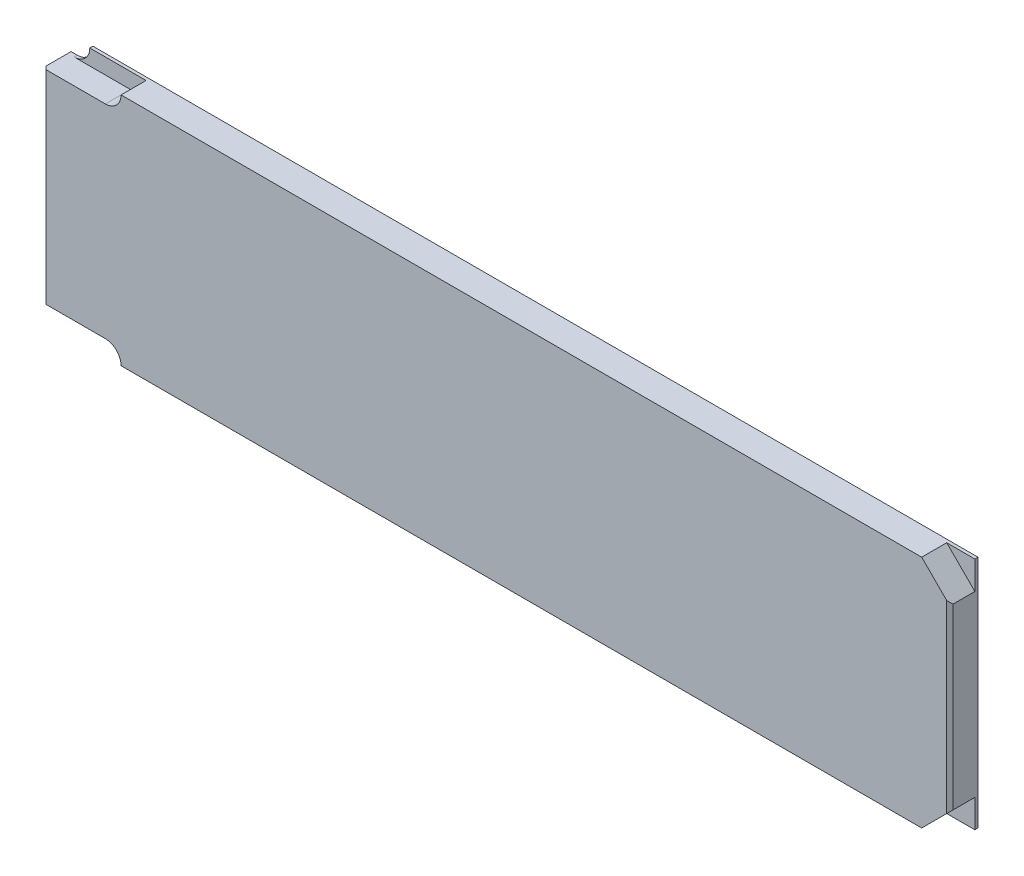
ISO-10303-21;
HEADER;
FILE_DESCRIPTION(('STEP AP214'),'2;1');
FILE_NAME('part.step','',(''),(''),'','','');
FILE_SCHEMA(('AUTOMOTIVE_DESIGN { 1 0 10303 214 1 1 1 1 }'));
ENDSEC;
DATA;
#1=APPLICATION_CONTEXT('core data for automotive mechanical design processes');
#2=APPLICATION_PROTOCOL_DEFINITION('international standard','automotive_design',2000,#1);
#3=PRODUCT_CONTEXT('',#1,'mechanical');
#4=PRODUCT('Part','Part','',(#3));
#5=PRODUCT_RELATED_PRODUCT_CATEGORY('part','',(#4));
#6=PRODUCT_DEFINITION_FORMATION('','',#4);
#7=PRODUCT_DEFINITION_CONTEXT('part definition',#1,'design');
#8=PRODUCT_DEFINITION('design','',#6,#7);
#9=PRODUCT_DEFINITION_SHAPE('','',#8);
#10=(LENGTH_UNIT() NAMED_UNIT(*) SI_UNIT(.MILLI.,.METRE.));
#11=(NAMED_UNIT(*) PLANE_ANGLE_UNIT() SI_UNIT($,.RADIAN.));
#12=(NAMED_UNIT(*) SI_UNIT($,.STERADIAN.) SOLID_ANGLE_UNIT());
#13=UNCERTAINTY_MEASURE_WITH_UNIT(LENGTH_MEASURE(1.E-05),#10,'distance_accuracy_value','');
#14=(GEOMETRIC_REPRESENTATION_CONTEXT(3) GLOBAL_UNCERTAINTY_ASSIGNED_CONTEXT((#13)) GLOBAL_UNIT_ASSIGNED_CONTEXT((#10,
#11,#12)) REPRESENTATION_CONTEXT('',''));
#15=CARTESIAN_POINT('',(0.,0.,0.));
#16=DIRECTION('',(0.,0.,1.));
#17=DIRECTION('',(1.,0.,0.));
#18=AXIS2_PLACEMENT_3D('',#15,#16,#17);
#19=CARTESIAN_POINT('',(290.,0.,9.));
#20=DIRECTION('',(-1.,0.,0.));
#21=DIRECTION('',(0.,0.,1.));
#22=AXIS2_PLACEMENT_3D('',#19,#20,#21);
#23=PLANE('',#22);
#24=DIRECTION('',(0.,0.,1.));
#25=VECTOR('',#24,1.);
#26=CARTESIAN_POINT('',(290.,66.0000000000001,0.999999999999999));
#27=LINE('',#26,#25);
#28=CARTESIAN_POINT('',(290.,66.0000000000001,0.999999999999999));
#29=VERTEX_POINT('',#28);
#30=CARTESIAN_POINT('',(290.,66.0000000000001,8.));
#31=VERTEX_POINT('',#30);
#32=EDGE_CURVE('E223',#29,#31,#27,.T.);
#33=ORIENTED_EDGE('',*,*,#32,.T.);
#34=DIRECTION('',(0.,-1.,0.));
#35=VECTOR('',#34,1.);
#36=CARTESIAN_POINT('',(290.,0.,8.));
#37=LINE('',#36,#35);
#38=CARTESIAN_POINT('',(290.,8.99999999999999,8.00000000000001));
#39=VERTEX_POINT('',#38);
#40=EDGE_CURVE('E281',#31,#39,#37,.T.);
#41=ORIENTED_EDGE('',*,*,#40,.T.);
#42=DIRECTION('',(0.,0.,1.));
#43=VECTOR('',#42,1.);
#44=CARTESIAN_POINT('',(290.,9.,0.999999999999999));
#45=LINE('',#44,#43);
#46=CARTESIAN_POINT('',(290.,9.,0.999999999999999));
#47=VERTEX_POINT('',#46);
#48=EDGE_CURVE('E204',#47,#39,#45,.T.);
#49=ORIENTED_EDGE('',*,*,#48,.F.);
#50=DIRECTION('',(0.,1.,0.));
#51=VECTOR('',#50,1.);
#52=CARTESIAN_POINT('',(290.,0.,0.999999999999999));
#53=LINE('',#52,#51);
#54=CARTESIAN_POINT('',(290.,0.,0.999999999999999));
#55=VERTEX_POINT('',#54);
#56=EDGE_CURVE('E199',#55,#47,#53,.T.);
#57=ORIENTED_EDGE('',*,*,#56,.F.);
#58=DIRECTION('',(0.,0.,-1.));
#59=VECTOR('',#58,1.);
#60=CARTESIAN_POINT('',(290.,0.,9.));
#61=LINE('',#60,#59);
#62=CARTESIAN_POINT('',(290.,0.,0.));
#63=VERTEX_POINT('',#62);
#64=EDGE_CURVE('E239',#55,#63,#61,.T.);
#65=ORIENTED_EDGE('',*,*,#64,.T.);
#66=DIRECTION('',(0.,1.,0.));
#67=VECTOR('',#66,1.);
#68=CARTESIAN_POINT('',(290.,0.,0.));
#69=LINE('',#68,#67);
#70=CARTESIAN_POINT('',(290.,75.,0.));
#71=VERTEX_POINT('',#70);
#72=EDGE_CURVE('E226',#63,#71,#69,.T.);
#73=ORIENTED_EDGE('',*,*,#72,.T.);
#74=DIRECTION('',(0.,0.,-1.));
#75=VECTOR('',#74,1.);
#76=CARTESIAN_POINT('',(290.,75.,9.));
#77=LINE('',#76,#75);
#78=CARTESIAN_POINT('',(290.,75.,0.999999999999999));
#79=VERTEX_POINT('',#78);
#80=EDGE_CURVE('E264',#79,#71,#77,.T.);
#81=ORIENTED_EDGE('',*,*,#80,.F.);
#82=DIRECTION('',(0.,1.,0.));
#83=VECTOR('',#82,1.);
#84=CARTESIAN_POINT('',(290.,66.0000000000001,0.999999999999999));
#85=LINE('',#84,#83);
#86=EDGE_CURVE('E218',#29,#79,#85,.T.);
#87=ORIENTED_EDGE('',*,*,#86,.F.);
#88=EDGE_LOOP('',(#33,#41,#49,#57,#65,#73,#81,#87));
#89=FACE_BOUND('',#88,.T.);
#90=ADVANCED_FACE('F39',(#89),#23,.F.);
#91=CARTESIAN_POINT('',(7.,75.,9.));
#92=DIRECTION('',(0.,-1.,0.));
#93=DIRECTION('',(0.,0.,-1.));
#94=AXIS2_PLACEMENT_3D('',#91,#92,#93);
#95=PLANE('',#94);
#96=DIRECTION('',(-1.,0.,0.));
#97=VECTOR('',#96,1.);
#98=CARTESIAN_POINT('',(25.,75.,0.999999999999999));
#99=LINE('',#98,#97);
#100=CARTESIAN_POINT('',(25.,75.,0.999999999999999));
#101=VERTEX_POINT('',#100);
#102=CARTESIAN_POINT('',(7.,75.,0.999999999999999));
#103=VERTEX_POINT('',#102);
#104=EDGE_CURVE('E165',#101,#103,#99,.T.);
#105=ORIENTED_EDGE('',*,*,#104,.F.);
#106=DIRECTION('',(0.,0.,1.));
#107=VECTOR('',#106,1.);
#108=CARTESIAN_POINT('',(25.,75.,0.999999999999999));
#109=LINE('',#108,#107);
#110=CARTESIAN_POINT('',(25.,75.,9.));
#111=VERTEX_POINT('',#110);
#112=EDGE_CURVE('E178',#101,#111,#109,.T.);
#113=ORIENTED_EDGE('',*,*,#112,.T.);
#114=DIRECTION('',(-1.,0.,0.));
#115=VECTOR('',#114,1.);
#116=CARTESIAN_POINT('',(7.,75.,9.));
#117=LINE('',#116,#115);
#118=CARTESIAN_POINT('',(281.,75.,9.));
#119=VERTEX_POINT('',#118);
#120=EDGE_CURVE('E228',#119,#111,#117,.T.);
#121=ORIENTED_EDGE('',*,*,#120,.F.);
#122=DIRECTION('',(0.,0.,1.));
#123=VECTOR('',#122,1.);
#124=CARTESIAN_POINT('',(281.,75.,0.999999999999999));
#125=LINE('',#124,#123);
#126=CARTESIAN_POINT('',(281.,75.,0.999999999999999));
#127=VERTEX_POINT('',#126);
#128=EDGE_CURVE('E220',#127,#119,#125,.T.);
#129=ORIENTED_EDGE('',*,*,#128,.F.);
#130=DIRECTION('',(-1.,0.,0.));
#131=VECTOR('',#130,1.);
#132=CARTESIAN_POINT('',(290.,75.,0.999999999999999));
#133=LINE('',#132,#131);
#134=EDGE_CURVE('E212',#79,#127,#133,.T.);
#135=ORIENTED_EDGE('',*,*,#134,.F.);
#136=ORIENTED_EDGE('',*,*,#80,.T.);
#137=DIRECTION('',(-1.,0.,0.));
#138=VECTOR('',#137,1.);
#139=CARTESIAN_POINT('',(7.,75.,0.));
#140=LINE('',#139,#138);
#141=CARTESIAN_POINT('',(7.,75.,0.));
#142=VERTEX_POINT('',#141);
#143=EDGE_CURVE('E242',#71,#142,#140,.T.);
#144=ORIENTED_EDGE('',*,*,#143,.T.);
#145=DIRECTION('',(0.,0.,-1.));
#146=VECTOR('',#145,1.);
#147=CARTESIAN_POINT('',(7.,75.,9.));
#148=LINE('',#147,#146);
#149=EDGE_CURVE('E182',#103,#142,#148,.T.);
#150=ORIENTED_EDGE('',*,*,#149,.F.);
#151=EDGE_LOOP('',(#105,#113,#121,#129,#135,#136,#144,#150));
#152=FACE_BOUND('',#151,.T.);
#153=ADVANCED_FACE('F176',(#152),#95,.F.);
#154=CARTESIAN_POINT('',(0.,70.,9.));
#155=DIRECTION('',(0.,-1.,0.));
#156=DIRECTION('',(0.,0.,-1.));
#157=AXIS2_PLACEMENT_3D('',#154,#155,#156);
#158=PLANE('',#157);
#159=DIRECTION('',(-1.,0.,0.));
#160=VECTOR('',#159,1.);
#161=CARTESIAN_POINT('',(0.,70.,9.));
#162=LINE('',#161,#160);
#163=CARTESIAN_POINT('',(20.,70.,9.));
#164=VERTEX_POINT('',#163);
#165=CARTESIAN_POINT('',(1.,70.,9.));
#166=VERTEX_POINT('',#165);
#167=EDGE_CURVE('E230',#164,#166,#162,.T.);
#168=ORIENTED_EDGE('',*,*,#167,.F.);
#169=DIRECTION('',(0.,0.,1.));
#170=VECTOR('',#169,1.);
#171=CARTESIAN_POINT('',(20.,70.,0.999999999999999));
#172=LINE('',#171,#170);
#173=CARTESIAN_POINT('',(20.,70.,0.999999999999999));
#174=VERTEX_POINT('',#173);
#175=EDGE_CURVE('E172',#164,#174,#172,.F.);
#176=ORIENTED_EDGE('',*,*,#175,.T.);
#177=DIRECTION('',(1.,0.,0.));
#178=VECTOR('',#177,1.);
#179=CARTESIAN_POINT('',(25.,70.,0.999999999999999));
#180=LINE('',#179,#178);
#181=CARTESIAN_POINT('',(2.,70.,0.999999999999999));
#182=VERTEX_POINT('',#181);
#183=EDGE_CURVE('E167',#182,#174,#180,.T.);
#184=ORIENTED_EDGE('',*,*,#183,.F.);
#185=DIRECTION('',(0.,0.,-1.));
#186=VECTOR('',#185,1.);
#187=CARTESIAN_POINT('',(2.,70.,0.));
#188=LINE('',#187,#186);
#189=CARTESIAN_POINT('',(2.,70.,0.));
#190=VERTEX_POINT('',#189);
#191=EDGE_CURVE('E285',#182,#190,#188,.T.);
#192=ORIENTED_EDGE('',*,*,#191,.T.);
#193=DIRECTION('',(-1.,0.,0.));
#194=VECTOR('',#193,1.);
#195=CARTESIAN_POINT('',(0.,70.,0.));
#196=LINE('',#195,#194);
#197=CARTESIAN_POINT('',(0.,70.,0.));
#198=VERTEX_POINT('',#197);
#199=EDGE_CURVE('E244',#190,#198,#196,.T.);
#200=ORIENTED_EDGE('',*,*,#199,.T.);
#201=DIRECTION('',(0.,0.,-1.));
#202=VECTOR('',#201,1.);
#203=CARTESIAN_POINT('',(0.,70.,9.));
#204=LINE('',#203,#202);
#205=CARTESIAN_POINT('',(0.,70.,8.));
#206=VERTEX_POINT('',#205);
#207=EDGE_CURVE('E260',#206,#198,#204,.T.);
#208=ORIENTED_EDGE('',*,*,#207,.F.);
#209=DIRECTION('',(-0.707106781186547,0.,-0.707106781186548));
#210=VECTOR('',#209,1.);
#211=CARTESIAN_POINT('',(1.,70.,9.));
#212=LINE('',#211,#210);
#213=EDGE_CURVE('E276',#206,#166,#212,.F.);
#214=ORIENTED_EDGE('',*,*,#213,.T.);
#215=EDGE_LOOP('',(#168,#176,#184,#192,#200,#208,#214));
#216=FACE_BOUND('',#215,.T.);
#217=ADVANCED_FACE('F337',(#216),#158,.F.);
#218=CARTESIAN_POINT('',(0.,5.,9.));
#219=DIRECTION('',(1.,0.,0.));
#220=DIRECTION('',(0.,0.,-1.));
#221=AXIS2_PLACEMENT_3D('',#218,#219,#220);
#222=PLANE('',#221);
#223=DIRECTION('',(0.,0.,-1.));
#224=VECTOR('',#223,1.);
#225=CARTESIAN_POINT('',(0.,5.,9.));
#226=LINE('',#225,#224);
#227=CARTESIAN_POINT('',(0.,5.,8.));
#228=VERTEX_POINT('',#227);
#229=CARTESIAN_POINT('',(0.,5.,0.));
#230=VERTEX_POINT('',#229);
#231=EDGE_CURVE('E258',#228,#230,#226,.T.);
#232=ORIENTED_EDGE('',*,*,#231,.F.);
#233=DIRECTION('',(0.,1.,0.));
#234=VECTOR('',#233,1.);
#235=CARTESIAN_POINT('',(0.,5.,8.));
#236=LINE('',#235,#234);
#237=EDGE_CURVE('E274',#228,#206,#236,.T.);
#238=ORIENTED_EDGE('',*,*,#237,.T.);
#239=ORIENTED_EDGE('',*,*,#207,.T.);
#240=DIRECTION('',(0.,-1.,0.));
#241=VECTOR('',#240,1.);
#242=CARTESIAN_POINT('',(0.,5.,0.));
#243=LINE('',#242,#241);
#244=EDGE_CURVE('E246',#198,#230,#243,.T.);
#245=ORIENTED_EDGE('',*,*,#244,.T.);
#246=EDGE_LOOP('',(#232,#238,#239,#245));
#247=FACE_BOUND('',#246,.T.);
#248=ADVANCED_FACE('F332',(#247),#222,.F.);
#249=CARTESIAN_POINT('',(7.,5.,9.));
#250=DIRECTION('',(0.,1.,0.));
#251=DIRECTION('',(-1.,0.,0.));
#252=AXIS2_PLACEMENT_3D('',#249,#250,#251);
#253=PLANE('',#252);
#254=DIRECTION('',(-1.,0.,0.));
#255=VECTOR('',#254,1.);
#256=CARTESIAN_POINT('',(0.,5.,0.999999999999999));
#257=LINE('',#256,#255);
#258=CARTESIAN_POINT('',(20.,5.,0.999999999999999));
#259=VERTEX_POINT('',#258);
#260=CARTESIAN_POINT('',(2.,5.,0.999999999999999));
#261=VERTEX_POINT('',#260);
#262=EDGE_CURVE('E53',#259,#261,#257,.T.);
#263=ORIENTED_EDGE('',*,*,#262,.F.);
#264=DIRECTION('',(0.,0.,1.));
#265=VECTOR('',#264,1.);
#266=CARTESIAN_POINT('',(20.,5.,9.));
#267=LINE('',#266,#265);
#268=CARTESIAN_POINT('',(20.,5.,9.));
#269=VERTEX_POINT('',#268);
#270=EDGE_CURVE('E290',#259,#269,#267,.T.);
#271=ORIENTED_EDGE('',*,*,#270,.T.);
#272=DIRECTION('',(1.,0.,0.));
#273=VECTOR('',#272,1.);
#274=CARTESIAN_POINT('',(7.,5.,9.));
#275=LINE('',#274,#273);
#276=CARTESIAN_POINT('',(1.,5.,9.));
#277=VERTEX_POINT('',#276);
#278=EDGE_CURVE('E233',#277,#269,#275,.T.);
#279=ORIENTED_EDGE('',*,*,#278,.F.);
#280=DIRECTION('',(0.707106781186547,0.,0.707106781186548));
#281=VECTOR('',#280,1.);
#282=CARTESIAN_POINT('',(1.00000000000001,5.,9.00000000000001));
#283=LINE('',#282,#281);
#284=EDGE_CURVE('E272',#277,#228,#283,.F.);
#285=ORIENTED_EDGE('',*,*,#284,.T.);
#286=ORIENTED_EDGE('',*,*,#231,.T.);
#287=DIRECTION('',(1.,0.,0.));
#288=VECTOR('',#287,1.);
#289=CARTESIAN_POINT('',(7.,5.,0.));
#290=LINE('',#289,#288);
#291=CARTESIAN_POINT('',(2.,5.,0.));
#292=VERTEX_POINT('',#291);
#293=EDGE_CURVE('E249',#230,#292,#290,.T.);
#294=ORIENTED_EDGE('',*,*,#293,.T.);
#295=DIRECTION('',(0.,0.,-1.));
#296=VECTOR('',#295,1.);
#297=CARTESIAN_POINT('',(2.,5.,0.999999999999999));
#298=LINE('',#297,#296);
#299=EDGE_CURVE('E171',#292,#261,#298,.F.);
#300=ORIENTED_EDGE('',*,*,#299,.T.);
#301=EDGE_LOOP('',(#263,#271,#279,#285,#286,#294,#300));
#302=FACE_BOUND('',#301,.T.);
#303=ADVANCED_FACE('F310',(#302),#253,.F.);
#304=CARTESIAN_POINT('',(7.,0.,9.));
#305=DIRECTION('',(0.,1.,0.));
#306=DIRECTION('',(0.,0.,1.));
#307=AXIS2_PLACEMENT_3D('',#304,#305,#306);
#308=PLANE('',#307);
#309=DIRECTION('',(1.,0.,0.));
#310=VECTOR('',#309,1.);
#311=CARTESIAN_POINT('',(7.,0.,9.));
#312=LINE('',#311,#310);
#313=CARTESIAN_POINT('',(25.,0.,9.));
#314=VERTEX_POINT('',#313);
#315=CARTESIAN_POINT('',(281.,0.,9.));
#316=VERTEX_POINT('',#315);
#317=EDGE_CURVE('E236',#314,#316,#312,.T.);
#318=ORIENTED_EDGE('',*,*,#317,.F.);
#319=DIRECTION('',(0.,0.,1.));
#320=VECTOR('',#319,1.);
#321=CARTESIAN_POINT('',(25.,0.,0.999999999999999));
#322=LINE('',#321,#320);
#323=CARTESIAN_POINT('',(25.,0.,0.999999999999999));
#324=VERTEX_POINT('',#323);
#325=EDGE_CURVE('E193',#324,#314,#322,.T.);
#326=ORIENTED_EDGE('',*,*,#325,.F.);
#327=DIRECTION('',(1.,0.,0.));
#328=VECTOR('',#327,1.);
#329=CARTESIAN_POINT('',(0.,0.,0.999999999999999));
#330=LINE('',#329,#328);
#331=CARTESIAN_POINT('',(7.,0.,0.999999999999999));
#332=VERTEX_POINT('',#331);
#333=EDGE_CURVE('E187',#332,#324,#330,.T.);
#334=ORIENTED_EDGE('',*,*,#333,.F.);
#335=DIRECTION('',(0.,0.,-1.));
#336=VECTOR('',#335,1.);
#337=CARTESIAN_POINT('',(7.,0.,9.));
#338=LINE('',#337,#336);
#339=CARTESIAN_POINT('',(7.,0.,0.));
#340=VERTEX_POINT('',#339);
#341=EDGE_CURVE('E255',#332,#340,#338,.T.);
#342=ORIENTED_EDGE('',*,*,#341,.T.);
#343=DIRECTION('',(1.,0.,0.));
#344=VECTOR('',#343,1.);
#345=CARTESIAN_POINT('',(7.,0.,0.));
#346=LINE('',#345,#344);
#347=EDGE_CURVE('E231',#340,#63,#346,.T.);
#348=ORIENTED_EDGE('',*,*,#347,.T.);
#349=ORIENTED_EDGE('',*,*,#64,.F.);
#350=DIRECTION('',(1.,0.,0.));
#351=VECTOR('',#350,1.);
#352=CARTESIAN_POINT('',(281.,0.,0.999999999999999));
#353=LINE('',#352,#351);
#354=CARTESIAN_POINT('',(281.,0.,0.999999999999999));
#355=VERTEX_POINT('',#354);
#356=EDGE_CURVE('E197',#355,#55,#353,.T.);
#357=ORIENTED_EDGE('',*,*,#356,.F.);
#358=DIRECTION('',(0.,0.,1.));
#359=VECTOR('',#358,1.);
#360=CARTESIAN_POINT('',(281.,0.,0.999999999999999));
#361=LINE('',#360,#359);
#362=EDGE_CURVE('E206',#355,#316,#361,.T.);
#363=ORIENTED_EDGE('',*,*,#362,.T.);
#364=EDGE_LOOP('',(#318,#326,#334,#342,#348,#349,#357,#363));
#365=FACE_BOUND('',#364,.T.);
#366=ADVANCED_FACE('F318',(#365),#308,.F.);
#367=CARTESIAN_POINT('',(290.,75.,9.));
#368=DIRECTION('',(0.,0.,-1.));
#369=DIRECTION('',(-1.,0.,0.));
#370=AXIS2_PLACEMENT_3D('',#367,#368,#369);
#371=PLANE('',#370);
#372=ORIENTED_EDGE('',*,*,#120,.T.);
#373=CARTESIAN_POINT('',(20.,75.,9.));
#374=DIRECTION('',(0.,0.,-1.));
#375=DIRECTION('',(-1.,0.,0.));
#376=AXIS2_PLACEMENT_3D('',#373,#374,#375);
#377=CIRCLE('',#376,5.);
#378=EDGE_CURVE('E186',#111,#164,#377,.T.);
#379=ORIENTED_EDGE('',*,*,#378,.T.);
#380=ORIENTED_EDGE('',*,*,#167,.T.);
#381=DIRECTION('',(0.,-1.,0.));
#382=VECTOR('',#381,1.);
#383=CARTESIAN_POINT('',(1.,75.,9.));
#384=LINE('',#383,#382);
#385=EDGE_CURVE('E269',#166,#277,#384,.T.);
#386=ORIENTED_EDGE('',*,*,#385,.T.);
#387=ORIENTED_EDGE('',*,*,#278,.T.);
#388=CARTESIAN_POINT('',(20.,0.,9.));
#389=DIRECTION('',(0.,0.,-1.));
#390=DIRECTION('',(-1.,0.,0.));
#391=AXIS2_PLACEMENT_3D('',#388,#389,#390);
#392=CIRCLE('',#391,5.);
#393=EDGE_CURVE('E299',#269,#314,#392,.T.);
#394=ORIENTED_EDGE('',*,*,#393,.T.);
#395=ORIENTED_EDGE('',*,*,#317,.T.);
#396=DIRECTION('',(-0.707106781186548,-0.707106781186547,0.));
#397=VECTOR('',#396,1.);
#398=CARTESIAN_POINT('',(290.,9.,9.));
#399=LINE('',#398,#397);
#400=CARTESIAN_POINT('',(289.,8.,9.));
#401=VERTEX_POINT('',#400);
#402=EDGE_CURVE('E196',#401,#316,#399,.T.);
#403=ORIENTED_EDGE('',*,*,#402,.F.);
#404=DIRECTION('',(0.,1.,0.));
#405=VECTOR('',#404,1.);
#406=CARTESIAN_POINT('',(289.,75.,9.));
#407=LINE('',#406,#405);
#408=CARTESIAN_POINT('',(289.,67.0000000000001,9.));
#409=VERTEX_POINT('',#408);
#410=EDGE_CURVE('E266',#401,#409,#407,.T.);
#411=ORIENTED_EDGE('',*,*,#410,.T.);
#412=DIRECTION('',(0.707106781186552,-0.707106781186543,0.));
#413=VECTOR('',#412,1.);
#414=CARTESIAN_POINT('',(281.,75.,9.));
#415=LINE('',#414,#413);
#416=EDGE_CURVE('E209',#119,#409,#415,.T.);
#417=ORIENTED_EDGE('',*,*,#416,.F.);
#418=EDGE_LOOP('',(#372,#379,#380,#386,#387,#394,#395,#403,#411,#417));
#419=FACE_BOUND('',#418,.T.);
#420=ADVANCED_FACE('F324',(#419),#371,.F.);
#421=CARTESIAN_POINT('',(290.,75.,0.));
#422=DIRECTION('',(0.,0.,-1.));
#423=DIRECTION('',(-1.,0.,0.));
#424=AXIS2_PLACEMENT_3D('',#421,#422,#423);
#425=PLANE('',#424);
#426=ORIENTED_EDGE('',*,*,#72,.F.);
#427=ORIENTED_EDGE('',*,*,#347,.F.);
#428=CARTESIAN_POINT('',(2.,0.,0.));
#429=DIRECTION('',(0.,0.,-1.));
#430=DIRECTION('',(-1.,0.,0.));
#431=AXIS2_PLACEMENT_3D('',#428,#429,#430);
#432=CIRCLE('',#431,5.);
#433=EDGE_CURVE('E47',#340,#292,#432,.F.);
#434=ORIENTED_EDGE('',*,*,#433,.T.);
#435=ORIENTED_EDGE('',*,*,#293,.F.);
#436=ORIENTED_EDGE('',*,*,#244,.F.);
#437=ORIENTED_EDGE('',*,*,#199,.F.);
#438=CARTESIAN_POINT('',(2.,75.,0.));
#439=DIRECTION('',(0.,0.,-1.));
#440=DIRECTION('',(-1.,0.,0.));
#441=AXIS2_PLACEMENT_3D('',#438,#439,#440);
#442=CIRCLE('',#441,5.);
#443=EDGE_CURVE('E295',#190,#142,#442,.F.);
#444=ORIENTED_EDGE('',*,*,#443,.T.);
#445=ORIENTED_EDGE('',*,*,#143,.F.);
#446=EDGE_LOOP('',(#426,#427,#434,#435,#436,#437,#444,#445));
#447=FACE_BOUND('',#446,.T.);
#448=ADVANCED_FACE('F304',(#447),#425,.T.);
#449=CARTESIAN_POINT('',(281.,75.,0.999999999999999));
#450=DIRECTION('',(-0.707106781186543,-0.707106781186552,0.));
#451=DIRECTION('',(0.707106781186552,-0.707106781186543,0.));
#452=AXIS2_PLACEMENT_3D('',#449,#450,#451);
#453=PLANE('',#452);
#454=ORIENTED_EDGE('',*,*,#416,.T.);
#455=DIRECTION('',(-0.577350269189629,0.577350269189621,0.577350269189628));
#456=VECTOR('',#455,1.);
#457=CARTESIAN_POINT('',(286.333333333333,69.6666666666667,11.6666666666666));
#458=LINE('',#457,#456);
#459=EDGE_CURVE('E279',#409,#31,#458,.F.);
#460=ORIENTED_EDGE('',*,*,#459,.T.);
#461=ORIENTED_EDGE('',*,*,#32,.F.);
#462=DIRECTION('',(0.707106781186552,-0.707106781186543,0.));
#463=VECTOR('',#462,1.);
#464=CARTESIAN_POINT('',(281.,75.,0.999999999999999));
#465=LINE('',#464,#463);
#466=EDGE_CURVE('E215',#127,#29,#465,.T.);
#467=ORIENTED_EDGE('',*,*,#466,.F.);
#468=ORIENTED_EDGE('',*,*,#128,.T.);
#469=EDGE_LOOP('',(#454,#460,#461,#467,#468));
#470=FACE_BOUND('',#469,.T.);
#471=ADVANCED_FACE('F387',(#470),#453,.F.);
#472=CARTESIAN_POINT('',(290.,75.,0.999999999999999));
#473=DIRECTION('',(0.,0.,-1.));
#474=DIRECTION('',(-1.,0.,0.));
#475=AXIS2_PLACEMENT_3D('',#472,#473,#474);
#476=PLANE('',#475);
#477=ORIENTED_EDGE('',*,*,#134,.T.);
#478=ORIENTED_EDGE('',*,*,#466,.T.);
#479=ORIENTED_EDGE('',*,*,#86,.T.);
#480=EDGE_LOOP('',(#477,#478,#479));
#481=FACE_BOUND('',#480,.T.);
#482=ADVANCED_FACE('F385',(#481),#476,.F.);
#483=CARTESIAN_POINT('',(290.,9.,0.999999999999999));
#484=DIRECTION('',(-0.707106781186547,0.707106781186548,0.));
#485=DIRECTION('',(-0.707106781186548,-0.707106781186547,0.));
#486=AXIS2_PLACEMENT_3D('',#483,#484,#485);
#487=PLANE('',#486);
#488=ORIENTED_EDGE('',*,*,#48,.T.);
#489=DIRECTION('',(0.577350269189626,0.577350269189626,-0.577350269189625));
#490=VECTOR('',#489,1.);
#491=CARTESIAN_POINT('',(311.333333333333,30.3333333333333,-13.3333333333333));
#492=LINE('',#491,#490);
#493=EDGE_CURVE('E283',#39,#401,#492,.F.);
#494=ORIENTED_EDGE('',*,*,#493,.T.);
#495=ORIENTED_EDGE('',*,*,#402,.T.);
#496=ORIENTED_EDGE('',*,*,#362,.F.);
#497=DIRECTION('',(-0.707106781186548,-0.707106781186547,0.));
#498=VECTOR('',#497,1.);
#499=CARTESIAN_POINT('',(290.,9.,0.999999999999999));
#500=LINE('',#499,#498);
#501=EDGE_CURVE('E201',#47,#355,#500,.T.);
#502=ORIENTED_EDGE('',*,*,#501,.F.);
#503=EDGE_LOOP('',(#488,#494,#495,#496,#502));
#504=FACE_BOUND('',#503,.T.);
#505=ADVANCED_FACE('F371',(#504),#487,.F.);
#506=CARTESIAN_POINT('',(290.,0.,0.999999999999999));
#507=DIRECTION('',(0.,0.,1.));
#508=DIRECTION('',(1.,0.,0.));
#509=AXIS2_PLACEMENT_3D('',#506,#507,#508);
#510=PLANE('',#509);
#511=ORIENTED_EDGE('',*,*,#356,.T.);
#512=ORIENTED_EDGE('',*,*,#56,.T.);
#513=ORIENTED_EDGE('',*,*,#501,.T.);
#514=EDGE_LOOP('',(#511,#512,#513));
#515=FACE_BOUND('',#514,.T.);
#516=ADVANCED_FACE('F378',(#515),#510,.T.);
#517=CARTESIAN_POINT('',(0.,0.,0.999999999999999));
#518=DIRECTION('',(0.,0.,1.));
#519=DIRECTION('',(1.,0.,0.));
#520=AXIS2_PLACEMENT_3D('',#517,#518,#519);
#521=PLANE('',#520);
#522=ORIENTED_EDGE('',*,*,#333,.T.);
#523=CARTESIAN_POINT('',(20.,0.,0.999999999999999));
#524=DIRECTION('',(0.,0.,1.));
#525=DIRECTION('',(1.,0.,0.));
#526=AXIS2_PLACEMENT_3D('',#523,#524,#525);
#527=CIRCLE('',#526,5.);
#528=EDGE_CURVE('E58',#324,#259,#527,.T.);
#529=ORIENTED_EDGE('',*,*,#528,.T.);
#530=ORIENTED_EDGE('',*,*,#262,.T.);
#531=CARTESIAN_POINT('',(2.,0.,0.999999999999999));
#532=DIRECTION('',(0.,0.,1.));
#533=DIRECTION('',(1.,0.,0.));
#534=AXIS2_PLACEMENT_3D('',#531,#532,#533);
#535=CIRCLE('',#534,5.);
#536=EDGE_CURVE('E11',#261,#332,#535,.F.);
#537=ORIENTED_EDGE('',*,*,#536,.T.);
#538=EDGE_LOOP('',(#522,#529,#530,#537));
#539=FACE_BOUND('',#538,.T.);
#540=ADVANCED_FACE('F314',(#539),#521,.T.);
#541=CARTESIAN_POINT('',(0.,75.,0.999999999999999));
#542=DIRECTION('',(0.,0.,1.));
#543=DIRECTION('',(1.,0.,0.));
#544=AXIS2_PLACEMENT_3D('',#541,#542,#543);
#545=PLANE('',#544);
#546=ORIENTED_EDGE('',*,*,#183,.T.);
#547=CARTESIAN_POINT('',(20.,75.,0.999999999999999));
#548=DIRECTION('',(0.,0.,1.));
#549=DIRECTION('',(1.,0.,0.));
#550=AXIS2_PLACEMENT_3D('',#547,#548,#549);
#551=CIRCLE('',#550,5.);
#552=EDGE_CURVE('E161',#174,#101,#551,.T.);
#553=ORIENTED_EDGE('',*,*,#552,.T.);
#554=ORIENTED_EDGE('',*,*,#104,.T.);
#555=CARTESIAN_POINT('',(2.,75.,0.999999999999999));
#556=DIRECTION('',(0.,0.,1.));
#557=DIRECTION('',(1.,0.,0.));
#558=AXIS2_PLACEMENT_3D('',#555,#556,#557);
#559=CIRCLE('',#558,5.);
#560=EDGE_CURVE('E297',#103,#182,#559,.F.);
#561=ORIENTED_EDGE('',*,*,#560,.T.);
#562=EDGE_LOOP('',(#546,#553,#554,#561));
#563=FACE_BOUND('',#562,.T.);
#564=ADVANCED_FACE('F163',(#563),#545,.T.);
#565=CARTESIAN_POINT('',(1.,75.,9.));
#566=DIRECTION('',(0.707106781186548,0.,-0.707106781186547));
#567=DIRECTION('',(-0.707106781186547,0.,-0.707106781186548));
#568=AXIS2_PLACEMENT_3D('',#565,#566,#567);
#569=PLANE('',#568);
#570=ORIENTED_EDGE('',*,*,#213,.F.);
#571=ORIENTED_EDGE('',*,*,#237,.F.);
#572=ORIENTED_EDGE('',*,*,#284,.F.);
#573=ORIENTED_EDGE('',*,*,#385,.F.);
#574=EDGE_LOOP('',(#570,#571,#572,#573));
#575=FACE_BOUND('',#574,.T.);
#576=ADVANCED_FACE('F329',(#575),#569,.F.);
#577=CARTESIAN_POINT('',(289.,75.,9.));
#578=DIRECTION('',(-0.707106781186547,0.,-0.707106781186548));
#579=DIRECTION('',(-0.707106781186548,0.,0.707106781186547));
#580=AXIS2_PLACEMENT_3D('',#577,#578,#579);
#581=PLANE('',#580);
#582=ORIENTED_EDGE('',*,*,#493,.F.);
#583=ORIENTED_EDGE('',*,*,#40,.F.);
#584=ORIENTED_EDGE('',*,*,#459,.F.);
#585=ORIENTED_EDGE('',*,*,#410,.F.);
#586=EDGE_LOOP('',(#582,#583,#584,#585));
#587=FACE_BOUND('',#586,.T.);
#588=ADVANCED_FACE('F347',(#587),#581,.F.);
#589=CARTESIAN_POINT('',(20.,75.,0.999999999999999));
#590=DIRECTION('',(0.,0.,-1.));
#591=DIRECTION('',(-1.,0.,0.));
#592=AXIS2_PLACEMENT_3D('',#589,#590,#591);
#593=CYLINDRICAL_SURFACE('',#592,5.);
#594=ORIENTED_EDGE('',*,*,#552,.F.);
#595=ORIENTED_EDGE('',*,*,#175,.F.);
#596=ORIENTED_EDGE('',*,*,#378,.F.);
#597=ORIENTED_EDGE('',*,*,#112,.F.);
#598=EDGE_LOOP('',(#594,#595,#596,#597));
#599=FACE_BOUND('',#598,.T.);
#600=ADVANCED_FACE('F185',(#599),#593,.F.);
#601=CARTESIAN_POINT('',(2.,75.,9.));
#602=DIRECTION('',(0.,0.,1.));
#603=DIRECTION('',(1.,0.,0.));
#604=AXIS2_PLACEMENT_3D('',#601,#602,#603);
#605=CYLINDRICAL_SURFACE('',#604,5.);
#606=ORIENTED_EDGE('',*,*,#560,.F.);
#607=ORIENTED_EDGE('',*,*,#149,.T.);
#608=ORIENTED_EDGE('',*,*,#443,.F.);
#609=ORIENTED_EDGE('',*,*,#191,.F.);
#610=EDGE_LOOP('',(#606,#607,#608,#609));
#611=FACE_BOUND('',#610,.T.);
#612=ADVANCED_FACE('F340',(#611),#605,.F.);
#613=CARTESIAN_POINT('',(20.,0.,9.));
#614=DIRECTION('',(0.,0.,-1.));
#615=DIRECTION('',(-1.,0.,0.));
#616=AXIS2_PLACEMENT_3D('',#613,#614,#615);
#617=CYLINDRICAL_SURFACE('',#616,5.);
#618=ORIENTED_EDGE('',*,*,#528,.F.);
#619=ORIENTED_EDGE('',*,*,#325,.T.);
#620=ORIENTED_EDGE('',*,*,#393,.F.);
#621=ORIENTED_EDGE('',*,*,#270,.F.);
#622=EDGE_LOOP('',(#618,#619,#620,#621));
#623=FACE_BOUND('',#622,.T.);
#624=ADVANCED_FACE('F321',(#623),#617,.F.);
#625=CARTESIAN_POINT('',(2.,0.,9.));
#626=DIRECTION('',(0.,0.,1.));
#627=DIRECTION('',(1.,0.,0.));
#628=AXIS2_PLACEMENT_3D('',#625,#626,#627);
#629=CYLINDRICAL_SURFACE('',#628,5.);
#630=ORIENTED_EDGE('',*,*,#536,.F.);
#631=ORIENTED_EDGE('',*,*,#299,.F.);
#632=ORIENTED_EDGE('',*,*,#433,.F.);
#633=ORIENTED_EDGE('',*,*,#341,.F.);
#634=EDGE_LOOP('',(#630,#631,#632,#633));
#635=FACE_BOUND('',#634,.T.);
#636=ADVANCED_FACE('F41',(#635),#629,.F.);
#637=CLOSED_SHELL('',(#90,#153,#217,#248,#303,#366,#420,#448,#471,#482,#505,#516,#540,#564,#576,
#588,#600,#612,#624,#636));
#638=MANIFOLD_SOLID_BREP('B2',#637);
#639=ADVANCED_BREP_SHAPE_REPRESENTATION('',(#18,#638),#14);
#640=SHAPE_DEFINITION_REPRESENTATION(#9,#639);
ENDSEC;
END-ISO-10303-21;
